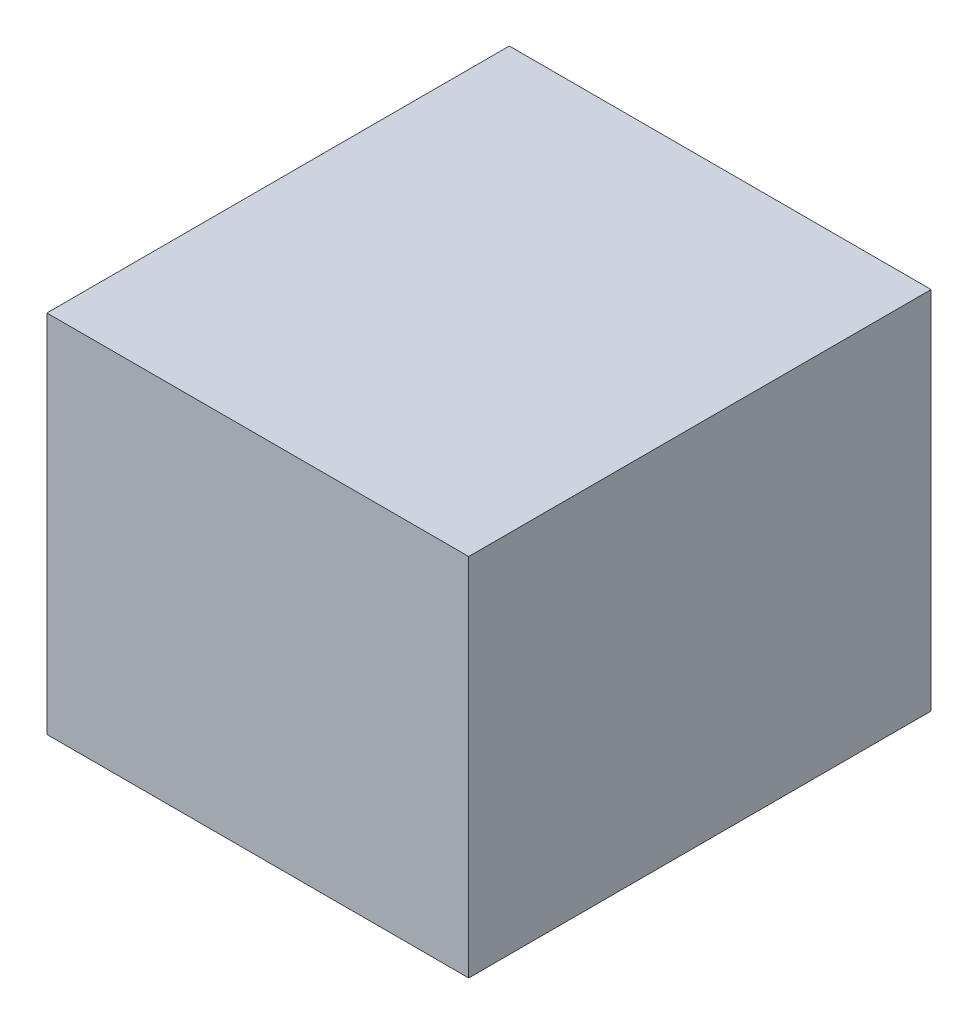
ISO-10303-21;
HEADER;
FILE_DESCRIPTION(('STEP AP214'),'2;1');
FILE_NAME('part.step','',(''),(''),'','','');
FILE_SCHEMA(('AUTOMOTIVE_DESIGN { 1 0 10303 214 1 1 1 1 }'));
ENDSEC;
DATA;
#1=APPLICATION_CONTEXT('core data for automotive mechanical design processes');
#2=APPLICATION_PROTOCOL_DEFINITION('international standard','automotive_design',2000,#1);
#3=PRODUCT_CONTEXT('',#1,'mechanical');
#4=PRODUCT('Part','Part','',(#3));
#5=PRODUCT_RELATED_PRODUCT_CATEGORY('part','',(#4));
#6=PRODUCT_DEFINITION_FORMATION('','',#4);
#7=PRODUCT_DEFINITION_CONTEXT('part definition',#1,'design');
#8=PRODUCT_DEFINITION('design','',#6,#7);
#9=PRODUCT_DEFINITION_SHAPE('','',#8);
#10=(LENGTH_UNIT() NAMED_UNIT(*) SI_UNIT(.MILLI.,.METRE.));
#11=(NAMED_UNIT(*) PLANE_ANGLE_UNIT() SI_UNIT($,.RADIAN.));
#12=(NAMED_UNIT(*) SI_UNIT($,.STERADIAN.) SOLID_ANGLE_UNIT());
#13=UNCERTAINTY_MEASURE_WITH_UNIT(LENGTH_MEASURE(1.E-05),#10,'distance_accuracy_value','');
#14=(GEOMETRIC_REPRESENTATION_CONTEXT(3) GLOBAL_UNCERTAINTY_ASSIGNED_CONTEXT((#13)) GLOBAL_UNIT_ASSIGNED_CONTEXT((#10,
#11,#12)) REPRESENTATION_CONTEXT('',''));
#15=CARTESIAN_POINT('',(0.,0.,0.));
#16=DIRECTION('',(0.,0.,1.));
#17=DIRECTION('',(1.,0.,0.));
#18=AXIS2_PLACEMENT_3D('',#15,#16,#17);
#19=CARTESIAN_POINT('',(-155.,0.,-560.));
#20=DIRECTION('',(1.,0.,0.));
#21=DIRECTION('',(0.,0.,-1.));
#22=AXIS2_PLACEMENT_3D('',#19,#20,#21);
#23=PLANE('',#22);
#24=DIRECTION('',(0.,0.,1.));
#25=VECTOR('',#24,1.);
#26=CARTESIAN_POINT('',(-155.,-225.,-560.));
#27=LINE('',#26,#25);
#28=CARTESIAN_POINT('',(-155.,-225.,-460.));
#29=VERTEX_POINT('',#28);
#30=CARTESIAN_POINT('',(-155.,-225.,0.));
#31=VERTEX_POINT('',#30);
#32=EDGE_CURVE('E101',#29,#31,#27,.T.);
#33=ORIENTED_EDGE('',*,*,#32,.F.);
#34=DIRECTION('',(0.,1.,0.));
#35=VECTOR('',#34,1.);
#36=CARTESIAN_POINT('',(-155.,0.,-460.));
#37=LINE('',#36,#35);
#38=CARTESIAN_POINT('',(-155.,-220.,-460.));
#39=VERTEX_POINT('',#38);
#40=EDGE_CURVE('E96',#29,#39,#37,.T.);
#41=ORIENTED_EDGE('',*,*,#40,.T.);
#42=DIRECTION('',(0.,0.,1.));
#43=VECTOR('',#42,1.);
#44=CARTESIAN_POINT('',(-155.,-220.,-560.));
#45=LINE('',#44,#43);
#46=CARTESIAN_POINT('',(-155.,-220.,0.));
#47=VERTEX_POINT('',#46);
#48=EDGE_CURVE('E209',#39,#47,#45,.T.);
#49=ORIENTED_EDGE('',*,*,#48,.T.);
#50=DIRECTION('',(0.,1.,0.));
#51=VECTOR('',#50,1.);
#52=CARTESIAN_POINT('',(-155.,0.,0.));
#53=LINE('',#52,#51);
#54=EDGE_CURVE('E210',#31,#47,#53,.T.);
#55=ORIENTED_EDGE('',*,*,#54,.F.);
#56=EDGE_LOOP('',(#33,#41,#49,#55));
#57=FACE_BOUND('',#56,.T.);
#58=ADVANCED_FACE('F79',(#57),#23,.T.);
#59=CARTESIAN_POINT('',(155.,-225.,-560.));
#60=DIRECTION('',(1.,0.,0.));
#61=DIRECTION('',(0.,0.,-1.));
#62=AXIS2_PLACEMENT_3D('',#59,#60,#61);
#63=PLANE('',#62);
#64=DIRECTION('',(0.,1.,0.));
#65=VECTOR('',#64,1.);
#66=CARTESIAN_POINT('',(155.,-225.,-460.));
#67=LINE('',#66,#65);
#68=CARTESIAN_POINT('',(155.,-225.,-460.));
#69=VERTEX_POINT('',#68);
#70=CARTESIAN_POINT('',(155.,-220.,-460.));
#71=VERTEX_POINT('',#70);
#72=EDGE_CURVE('E191',#69,#71,#67,.T.);
#73=ORIENTED_EDGE('',*,*,#72,.F.);
#74=DIRECTION('',(0.,0.,1.));
#75=VECTOR('',#74,1.);
#76=CARTESIAN_POINT('',(155.,-225.,-560.));
#77=LINE('',#76,#75);
#78=CARTESIAN_POINT('',(155.,-225.,0.));
#79=VERTEX_POINT('',#78);
#80=EDGE_CURVE('E214',#69,#79,#77,.T.);
#81=ORIENTED_EDGE('',*,*,#80,.T.);
#82=DIRECTION('',(0.,1.,0.));
#83=VECTOR('',#82,1.);
#84=CARTESIAN_POINT('',(155.,-225.,0.));
#85=LINE('',#84,#83);
#86=CARTESIAN_POINT('',(155.,-220.,0.));
#87=VERTEX_POINT('',#86);
#88=EDGE_CURVE('E197',#79,#87,#85,.T.);
#89=ORIENTED_EDGE('',*,*,#88,.T.);
#90=DIRECTION('',(0.,0.,1.));
#91=VECTOR('',#90,1.);
#92=CARTESIAN_POINT('',(155.,-220.,-560.));
#93=LINE('',#92,#91);
#94=EDGE_CURVE('E239',#71,#87,#93,.T.);
#95=ORIENTED_EDGE('',*,*,#94,.F.);
#96=EDGE_LOOP('',(#73,#81,#89,#95));
#97=FACE_BOUND('',#96,.T.);
#98=ADVANCED_FACE('F287',(#97),#63,.F.);
#99=CARTESIAN_POINT('',(260.,-225.,5.));
#100=DIRECTION('',(-1.,0.,0.));
#101=DIRECTION('',(0.,0.,1.));
#102=AXIS2_PLACEMENT_3D('',#99,#100,#101);
#103=PLANE('',#102);
#104=DIRECTION('',(0.,-1.,0.));
#105=VECTOR('',#104,1.);
#106=CARTESIAN_POINT('',(260.,225.,-565.));
#107=LINE('',#106,#105);
#108=CARTESIAN_POINT('',(260.,225.,-565.));
#109=VERTEX_POINT('',#108);
#110=CARTESIAN_POINT('',(260.,-225.,-565.));
#111=VERTEX_POINT('',#110);
#112=EDGE_CURVE('E184',#109,#111,#107,.T.);
#113=ORIENTED_EDGE('',*,*,#112,.F.);
#114=DIRECTION('',(0.,0.,-1.));
#115=VECTOR('',#114,1.);
#116=CARTESIAN_POINT('',(260.,225.,5.));
#117=LINE('',#116,#115);
#118=CARTESIAN_POINT('',(260.,225.,5.));
#119=VERTEX_POINT('',#118);
#120=EDGE_CURVE('E12',#119,#109,#117,.T.);
#121=ORIENTED_EDGE('',*,*,#120,.F.);
#122=DIRECTION('',(0.,1.,0.));
#123=VECTOR('',#122,1.);
#124=CARTESIAN_POINT('',(260.,-225.,5.));
#125=LINE('',#124,#123);
#126=CARTESIAN_POINT('',(260.,-225.,5.));
#127=VERTEX_POINT('',#126);
#128=EDGE_CURVE('E244',#127,#119,#125,.T.);
#129=ORIENTED_EDGE('',*,*,#128,.F.);
#130=DIRECTION('',(0.,0.,-1.));
#131=VECTOR('',#130,1.);
#132=CARTESIAN_POINT('',(260.,-225.,5.));
#133=LINE('',#132,#131);
#134=EDGE_CURVE('E252',#127,#111,#133,.T.);
#135=ORIENTED_EDGE('',*,*,#134,.T.);
#136=EDGE_LOOP('',(#113,#121,#129,#135));
#137=FACE_BOUND('',#136,.T.);
#138=ADVANCED_FACE('F81',(#137),#103,.F.);
#139=CARTESIAN_POINT('',(-260.,225.,5.));
#140=DIRECTION('',(0.,-1.,0.));
#141=DIRECTION('',(0.,0.,-1.));
#142=AXIS2_PLACEMENT_3D('',#139,#140,#141);
#143=PLANE('',#142);
#144=DIRECTION('',(1.,0.,0.));
#145=VECTOR('',#144,1.);
#146=CARTESIAN_POINT('',(-260.,225.,-565.));
#147=LINE('',#146,#145);
#148=CARTESIAN_POINT('',(-260.,225.,-565.));
#149=VERTEX_POINT('',#148);
#150=EDGE_CURVE('E178',#149,#109,#147,.T.);
#151=ORIENTED_EDGE('',*,*,#150,.F.);
#152=DIRECTION('',(0.,0.,-1.));
#153=VECTOR('',#152,1.);
#154=CARTESIAN_POINT('',(-260.,225.,5.));
#155=LINE('',#154,#153);
#156=CARTESIAN_POINT('',(-260.,225.,5.));
#157=VERTEX_POINT('',#156);
#158=EDGE_CURVE('E88',#157,#149,#155,.T.);
#159=ORIENTED_EDGE('',*,*,#158,.F.);
#160=DIRECTION('',(-1.,0.,0.));
#161=VECTOR('',#160,1.);
#162=CARTESIAN_POINT('',(-260.,225.,5.));
#163=LINE('',#162,#161);
#164=EDGE_CURVE('E247',#119,#157,#163,.T.);
#165=ORIENTED_EDGE('',*,*,#164,.F.);
#166=ORIENTED_EDGE('',*,*,#120,.T.);
#167=EDGE_LOOP('',(#151,#159,#165,#166));
#168=FACE_BOUND('',#167,.T.);
#169=ADVANCED_FACE('F179',(#168),#143,.F.);
#170=CARTESIAN_POINT('',(-260.,-225.,5.));
#171=DIRECTION('',(1.,0.,0.));
#172=DIRECTION('',(0.,0.,-1.));
#173=AXIS2_PLACEMENT_3D('',#170,#171,#172);
#174=PLANE('',#173);
#175=DIRECTION('',(0.,1.,0.));
#176=VECTOR('',#175,1.);
#177=CARTESIAN_POINT('',(-260.,225.,-565.));
#178=LINE('',#177,#176);
#179=CARTESIAN_POINT('',(-260.,-225.,-565.));
#180=VERTEX_POINT('',#179);
#181=EDGE_CURVE('E172',#180,#149,#178,.T.);
#182=ORIENTED_EDGE('',*,*,#181,.F.);
#183=DIRECTION('',(0.,0.,-1.));
#184=VECTOR('',#183,1.);
#185=CARTESIAN_POINT('',(-260.,-225.,5.));
#186=LINE('',#185,#184);
#187=CARTESIAN_POINT('',(-260.,-225.,5.));
#188=VERTEX_POINT('',#187);
#189=EDGE_CURVE('E175',#188,#180,#186,.T.);
#190=ORIENTED_EDGE('',*,*,#189,.F.);
#191=DIRECTION('',(0.,-1.,0.));
#192=VECTOR('',#191,1.);
#193=CARTESIAN_POINT('',(-260.,-225.,5.));
#194=LINE('',#193,#192);
#195=EDGE_CURVE('E173',#157,#188,#194,.T.);
#196=ORIENTED_EDGE('',*,*,#195,.F.);
#197=ORIENTED_EDGE('',*,*,#158,.T.);
#198=EDGE_LOOP('',(#182,#190,#196,#197));
#199=FACE_BOUND('',#198,.T.);
#200=ADVANCED_FACE('F169',(#199),#174,.F.);
#201=CARTESIAN_POINT('',(-260.,-225.,5.));
#202=DIRECTION('',(0.,1.,0.));
#203=DIRECTION('',(0.,0.,1.));
#204=AXIS2_PLACEMENT_3D('',#201,#202,#203);
#205=PLANE('',#204);
#206=CARTESIAN_POINT('',(-169.55,-225.,-10.));
#207=DIRECTION('',(0.,-1.,0.));
#208=DIRECTION('',(0.,0.,-1.));
#209=AXIS2_PLACEMENT_3D('',#206,#207,#208);
#210=CIRCLE('',#209,2.5);
#211=CARTESIAN_POINT('',(-169.55,-225.,-12.5));
#212=VERTEX_POINT('',#211);
#213=EDGE_CURVE('E261',#212,#212,#210,.T.);
#214=ORIENTED_EDGE('',*,*,#213,.F.);
#215=EDGE_LOOP('',(#214));
#216=FACE_BOUND('',#215,.T.);
#217=CARTESIAN_POINT('',(-169.55,-225.,-424.));
#218=DIRECTION('',(0.,-1.,0.));
#219=DIRECTION('',(0.,0.,-1.));
#220=AXIS2_PLACEMENT_3D('',#217,#218,#219);
#221=CIRCLE('',#220,2.5);
#222=CARTESIAN_POINT('',(-169.55,-225.,-426.5));
#223=VERTEX_POINT('',#222);
#224=EDGE_CURVE('E486',#223,#223,#221,.T.);
#225=ORIENTED_EDGE('',*,*,#224,.F.);
#226=EDGE_LOOP('',(#225));
#227=FACE_BOUND('',#226,.T.);
#228=CARTESIAN_POINT('',(-169.55,-225.,-450.));
#229=DIRECTION('',(0.,-1.,0.));
#230=DIRECTION('',(0.,0.,-1.));
#231=AXIS2_PLACEMENT_3D('',#228,#229,#230);
#232=CIRCLE('',#231,2.5);
#233=CARTESIAN_POINT('',(-169.55,-225.,-452.5));
#234=VERTEX_POINT('',#233);
#235=EDGE_CURVE('E279',#234,#234,#232,.T.);
#236=ORIENTED_EDGE('',*,*,#235,.F.);
#237=EDGE_LOOP('',(#236));
#238=FACE_BOUND('',#237,.T.);
#239=CARTESIAN_POINT('',(-169.55,-225.,-36.));
#240=DIRECTION('',(0.,-1.,0.));
#241=DIRECTION('',(0.,0.,-1.));
#242=AXIS2_PLACEMENT_3D('',#239,#240,#241);
#243=CIRCLE('',#242,2.5);
#244=CARTESIAN_POINT('',(-169.55,-225.,-38.5));
#245=VERTEX_POINT('',#244);
#246=EDGE_CURVE('E482',#245,#245,#243,.T.);
#247=ORIENTED_EDGE('',*,*,#246,.F.);
#248=EDGE_LOOP('',(#247));
#249=FACE_BOUND('',#248,.T.);
#250=ORIENTED_EDGE('',*,*,#80,.F.);
#251=DIRECTION('',(1.,0.,0.));
#252=VECTOR('',#251,1.);
#253=CARTESIAN_POINT('',(-260.,-225.,-460.));
#254=LINE('',#253,#252);
#255=EDGE_CURVE('E272',#29,#69,#254,.T.);
#256=ORIENTED_EDGE('',*,*,#255,.F.);
#257=ORIENTED_EDGE('',*,*,#32,.T.);
#258=DIRECTION('',(1.,0.,0.));
#259=VECTOR('',#258,1.);
#260=CARTESIAN_POINT('',(-260.,-225.,0.));
#261=LINE('',#260,#259);
#262=EDGE_CURVE('E243',#31,#79,#261,.T.);
#263=ORIENTED_EDGE('',*,*,#262,.T.);
#264=EDGE_LOOP('',(#250,#256,#257,#263));
#265=FACE_BOUND('',#264,.T.);
#266=ORIENTED_EDGE('',*,*,#189,.T.);
#267=DIRECTION('',(-1.,0.,0.));
#268=VECTOR('',#267,1.);
#269=CARTESIAN_POINT('',(-260.,-225.,-565.));
#270=LINE('',#269,#268);
#271=EDGE_CURVE('E189',#111,#180,#270,.T.);
#272=ORIENTED_EDGE('',*,*,#271,.F.);
#273=ORIENTED_EDGE('',*,*,#134,.F.);
#274=DIRECTION('',(1.,0.,0.));
#275=VECTOR('',#274,1.);
#276=CARTESIAN_POINT('',(-260.,-225.,5.));
#277=LINE('',#276,#275);
#278=EDGE_CURVE('E250',#188,#127,#277,.T.);
#279=ORIENTED_EDGE('',*,*,#278,.F.);
#280=EDGE_LOOP('',(#266,#272,#273,#279));
#281=FACE_BOUND('',#280,.T.);
#282=ADVANCED_FACE('F290',(#216,#227,#238,#249,#265,#281),#205,.F.);
#283=CARTESIAN_POINT('',(0.,0.,5.));
#284=DIRECTION('',(0.,0.,-1.));
#285=DIRECTION('',(-1.,0.,0.));
#286=AXIS2_PLACEMENT_3D('',#283,#284,#285);
#287=PLANE('',#286);
#288=ORIENTED_EDGE('',*,*,#128,.T.);
#289=ORIENTED_EDGE('',*,*,#164,.T.);
#290=ORIENTED_EDGE('',*,*,#195,.T.);
#291=ORIENTED_EDGE('',*,*,#278,.T.);
#292=EDGE_LOOP('',(#288,#289,#290,#291));
#293=FACE_BOUND('',#292,.T.);
#294=ADVANCED_FACE('F322',(#293),#287,.F.);
#295=CARTESIAN_POINT('',(0.,0.,0.));
#296=DIRECTION('',(0.,0.,-1.));
#297=DIRECTION('',(-1.,0.,0.));
#298=AXIS2_PLACEMENT_3D('',#295,#296,#297);
#299=PLANE('',#298);
#300=ORIENTED_EDGE('',*,*,#88,.F.);
#301=ORIENTED_EDGE('',*,*,#262,.F.);
#302=ORIENTED_EDGE('',*,*,#54,.T.);
#303=DIRECTION('',(1.,0.,0.));
#304=VECTOR('',#303,1.);
#305=CARTESIAN_POINT('',(0.,-220.,0.));
#306=LINE('',#305,#304);
#307=CARTESIAN_POINT('',(-255.,-220.,0.));
#308=VERTEX_POINT('',#307);
#309=EDGE_CURVE('E201',#308,#47,#306,.T.);
#310=ORIENTED_EDGE('',*,*,#309,.F.);
#311=DIRECTION('',(0.,1.,0.));
#312=VECTOR('',#311,1.);
#313=CARTESIAN_POINT('',(-255.,0.,0.));
#314=LINE('',#313,#312);
#315=CARTESIAN_POINT('',(-255.,220.,0.));
#316=VERTEX_POINT('',#315);
#317=EDGE_CURVE('E220',#308,#316,#314,.T.);
#318=ORIENTED_EDGE('',*,*,#317,.T.);
#319=DIRECTION('',(1.,0.,0.));
#320=VECTOR('',#319,1.);
#321=CARTESIAN_POINT('',(0.,220.,0.));
#322=LINE('',#321,#320);
#323=CARTESIAN_POINT('',(255.,220.,0.));
#324=VERTEX_POINT('',#323);
#325=EDGE_CURVE('E217',#316,#324,#322,.T.);
#326=ORIENTED_EDGE('',*,*,#325,.T.);
#327=DIRECTION('',(0.,1.,0.));
#328=VECTOR('',#327,1.);
#329=CARTESIAN_POINT('',(255.,0.,0.));
#330=LINE('',#329,#328);
#331=CARTESIAN_POINT('',(255.,-220.,0.));
#332=VERTEX_POINT('',#331);
#333=EDGE_CURVE('E213',#332,#324,#330,.T.);
#334=ORIENTED_EDGE('',*,*,#333,.F.);
#335=DIRECTION('',(-1.,0.,0.));
#336=VECTOR('',#335,1.);
#337=CARTESIAN_POINT('',(260.,-220.,0.));
#338=LINE('',#337,#336);
#339=EDGE_CURVE('E236',#332,#87,#338,.T.);
#340=ORIENTED_EDGE('',*,*,#339,.T.);
#341=EDGE_LOOP('',(#300,#301,#302,#310,#318,#326,#334,#340));
#342=FACE_BOUND('',#341,.T.);
#343=ADVANCED_FACE('F294',(#342),#299,.T.);
#344=CARTESIAN_POINT('',(0.,220.,-560.));
#345=DIRECTION('',(0.,-1.,0.));
#346=DIRECTION('',(0.,0.,-1.));
#347=AXIS2_PLACEMENT_3D('',#344,#345,#346);
#348=PLANE('',#347);
#349=DIRECTION('',(0.,0.,1.));
#350=VECTOR('',#349,1.);
#351=CARTESIAN_POINT('',(255.,220.,-560.));
#352=LINE('',#351,#350);
#353=CARTESIAN_POINT('',(255.,220.,-560.));
#354=VERTEX_POINT('',#353);
#355=EDGE_CURVE('E230',#354,#324,#352,.T.);
#356=ORIENTED_EDGE('',*,*,#355,.T.);
#357=ORIENTED_EDGE('',*,*,#325,.F.);
#358=DIRECTION('',(0.,0.,1.));
#359=VECTOR('',#358,1.);
#360=CARTESIAN_POINT('',(-255.,220.,-560.));
#361=LINE('',#360,#359);
#362=CARTESIAN_POINT('',(-255.,220.,-560.));
#363=VERTEX_POINT('',#362);
#364=EDGE_CURVE('E228',#363,#316,#361,.T.);
#365=ORIENTED_EDGE('',*,*,#364,.F.);
#366=DIRECTION('',(1.,0.,0.));
#367=VECTOR('',#366,1.);
#368=CARTESIAN_POINT('',(0.,220.,-560.));
#369=LINE('',#368,#367);
#370=EDGE_CURVE('E200',#363,#354,#369,.T.);
#371=ORIENTED_EDGE('',*,*,#370,.T.);
#372=EDGE_LOOP('',(#356,#357,#365,#371));
#373=FACE_BOUND('',#372,.T.);
#374=ADVANCED_FACE('F314',(#373),#348,.T.);
#375=CARTESIAN_POINT('',(-255.,0.,-560.));
#376=DIRECTION('',(1.,0.,0.));
#377=DIRECTION('',(0.,0.,-1.));
#378=AXIS2_PLACEMENT_3D('',#375,#376,#377);
#379=PLANE('',#378);
#380=ORIENTED_EDGE('',*,*,#364,.T.);
#381=ORIENTED_EDGE('',*,*,#317,.F.);
#382=DIRECTION('',(0.,0.,1.));
#383=VECTOR('',#382,1.);
#384=CARTESIAN_POINT('',(-255.,-220.,-560.));
#385=LINE('',#384,#383);
#386=CARTESIAN_POINT('',(-255.,-220.,-560.));
#387=VERTEX_POINT('',#386);
#388=EDGE_CURVE('E226',#387,#308,#385,.T.);
#389=ORIENTED_EDGE('',*,*,#388,.F.);
#390=DIRECTION('',(0.,1.,0.));
#391=VECTOR('',#390,1.);
#392=CARTESIAN_POINT('',(-255.,0.,-560.));
#393=LINE('',#392,#391);
#394=EDGE_CURVE('E204',#387,#363,#393,.T.);
#395=ORIENTED_EDGE('',*,*,#394,.T.);
#396=EDGE_LOOP('',(#380,#381,#389,#395));
#397=FACE_BOUND('',#396,.T.);
#398=ADVANCED_FACE('F311',(#397),#379,.T.);
#399=CARTESIAN_POINT('',(0.,-220.,-560.));
#400=DIRECTION('',(0.,-1.,0.));
#401=DIRECTION('',(0.,0.,-1.));
#402=AXIS2_PLACEMENT_3D('',#399,#400,#401);
#403=PLANE('',#402);
#404=CARTESIAN_POINT('',(-169.55,-220.,-10.));
#405=DIRECTION('',(0.,-1.,0.));
#406=DIRECTION('',(0.,0.,-1.));
#407=AXIS2_PLACEMENT_3D('',#404,#405,#406);
#408=CIRCLE('',#407,2.5);
#409=CARTESIAN_POINT('',(-169.55,-220.,-12.5));
#410=VERTEX_POINT('',#409);
#411=EDGE_CURVE('E83',#410,#410,#408,.T.);
#412=ORIENTED_EDGE('',*,*,#411,.T.);
#413=EDGE_LOOP('',(#412));
#414=FACE_BOUND('',#413,.T.);
#415=CARTESIAN_POINT('',(-169.55,-220.,-424.));
#416=DIRECTION('',(0.,-1.,0.));
#417=DIRECTION('',(0.,0.,-1.));
#418=AXIS2_PLACEMENT_3D('',#415,#416,#417);
#419=CIRCLE('',#418,2.5);
#420=CARTESIAN_POINT('',(-169.55,-220.,-426.5));
#421=VERTEX_POINT('',#420);
#422=EDGE_CURVE('E263',#421,#421,#419,.T.);
#423=ORIENTED_EDGE('',*,*,#422,.T.);
#424=EDGE_LOOP('',(#423));
#425=FACE_BOUND('',#424,.T.);
#426=CARTESIAN_POINT('',(-169.55,-220.,-450.));
#427=DIRECTION('',(0.,-1.,0.));
#428=DIRECTION('',(0.,0.,-1.));
#429=AXIS2_PLACEMENT_3D('',#426,#427,#428);
#430=CIRCLE('',#429,2.5);
#431=CARTESIAN_POINT('',(-169.55,-220.,-452.5));
#432=VERTEX_POINT('',#431);
#433=EDGE_CURVE('E260',#432,#432,#430,.T.);
#434=ORIENTED_EDGE('',*,*,#433,.T.);
#435=EDGE_LOOP('',(#434));
#436=FACE_BOUND('',#435,.T.);
#437=CARTESIAN_POINT('',(-169.55,-220.,-36.));
#438=DIRECTION('',(0.,-1.,0.));
#439=DIRECTION('',(0.,0.,-1.));
#440=AXIS2_PLACEMENT_3D('',#437,#438,#439);
#441=CIRCLE('',#440,2.5);
#442=CARTESIAN_POINT('',(-169.55,-220.,-38.5));
#443=VERTEX_POINT('',#442);
#444=EDGE_CURVE('E257',#443,#443,#441,.T.);
#445=ORIENTED_EDGE('',*,*,#444,.T.);
#446=EDGE_LOOP('',(#445));
#447=FACE_BOUND('',#446,.T.);
#448=ORIENTED_EDGE('',*,*,#388,.T.);
#449=ORIENTED_EDGE('',*,*,#309,.T.);
#450=ORIENTED_EDGE('',*,*,#48,.F.);
#451=DIRECTION('',(1.,0.,0.));
#452=VECTOR('',#451,1.);
#453=CARTESIAN_POINT('',(-255.,-220.,-460.));
#454=LINE('',#453,#452);
#455=EDGE_CURVE('E268',#39,#71,#454,.T.);
#456=ORIENTED_EDGE('',*,*,#455,.T.);
#457=ORIENTED_EDGE('',*,*,#94,.T.);
#458=ORIENTED_EDGE('',*,*,#339,.F.);
#459=DIRECTION('',(0.,0.,1.));
#460=VECTOR('',#459,1.);
#461=CARTESIAN_POINT('',(255.,-220.,-560.));
#462=LINE('',#461,#460);
#463=CARTESIAN_POINT('',(255.,-220.,-560.));
#464=VERTEX_POINT('',#463);
#465=EDGE_CURVE('E233',#464,#332,#462,.T.);
#466=ORIENTED_EDGE('',*,*,#465,.F.);
#467=DIRECTION('',(1.,0.,0.));
#468=VECTOR('',#467,1.);
#469=CARTESIAN_POINT('',(0.,-220.,-560.));
#470=LINE('',#469,#468);
#471=EDGE_CURVE('E207',#387,#464,#470,.T.);
#472=ORIENTED_EDGE('',*,*,#471,.F.);
#473=EDGE_LOOP('',(#448,#449,#450,#456,#457,#458,#466,#472));
#474=FACE_BOUND('',#473,.T.);
#475=ADVANCED_FACE('F299',(#414,#425,#436,#447,#474),#403,.F.);
#476=CARTESIAN_POINT('',(255.,0.,-560.));
#477=DIRECTION('',(1.,0.,0.));
#478=DIRECTION('',(0.,0.,-1.));
#479=AXIS2_PLACEMENT_3D('',#476,#477,#478);
#480=PLANE('',#479);
#481=ORIENTED_EDGE('',*,*,#465,.T.);
#482=ORIENTED_EDGE('',*,*,#333,.T.);
#483=ORIENTED_EDGE('',*,*,#355,.F.);
#484=DIRECTION('',(0.,1.,0.));
#485=VECTOR('',#484,1.);
#486=CARTESIAN_POINT('',(255.,0.,-560.));
#487=LINE('',#486,#485);
#488=EDGE_CURVE('E198',#464,#354,#487,.T.);
#489=ORIENTED_EDGE('',*,*,#488,.F.);
#490=EDGE_LOOP('',(#481,#482,#483,#489));
#491=FACE_BOUND('',#490,.T.);
#492=ADVANCED_FACE('F304',(#491),#480,.F.);
#493=CARTESIAN_POINT('',(0.,0.,-565.));
#494=DIRECTION('',(0.,0.,1.));
#495=DIRECTION('',(1.,0.,0.));
#496=AXIS2_PLACEMENT_3D('',#493,#494,#495);
#497=PLANE('',#496);
#498=ORIENTED_EDGE('',*,*,#181,.T.);
#499=ORIENTED_EDGE('',*,*,#150,.T.);
#500=ORIENTED_EDGE('',*,*,#112,.T.);
#501=ORIENTED_EDGE('',*,*,#271,.T.);
#502=EDGE_LOOP('',(#498,#499,#500,#501));
#503=FACE_BOUND('',#502,.T.);
#504=ADVANCED_FACE('F187',(#503),#497,.F.);
#505=CARTESIAN_POINT('',(0.,0.,-560.));
#506=DIRECTION('',(0.,0.,1.));
#507=DIRECTION('',(1.,0.,0.));
#508=AXIS2_PLACEMENT_3D('',#505,#506,#507);
#509=PLANE('',#508);
#510=ORIENTED_EDGE('',*,*,#471,.T.);
#511=ORIENTED_EDGE('',*,*,#488,.T.);
#512=ORIENTED_EDGE('',*,*,#370,.F.);
#513=ORIENTED_EDGE('',*,*,#394,.F.);
#514=EDGE_LOOP('',(#510,#511,#512,#513));
#515=FACE_BOUND('',#514,.T.);
#516=ADVANCED_FACE('F306',(#515),#509,.T.);
#517=CARTESIAN_POINT('',(0.,0.,-460.));
#518=DIRECTION('',(0.,0.,-1.));
#519=DIRECTION('',(-1.,0.,0.));
#520=AXIS2_PLACEMENT_3D('',#517,#518,#519);
#521=PLANE('',#520);
#522=ORIENTED_EDGE('',*,*,#40,.F.);
#523=ORIENTED_EDGE('',*,*,#255,.T.);
#524=ORIENTED_EDGE('',*,*,#72,.T.);
#525=ORIENTED_EDGE('',*,*,#455,.F.);
#526=EDGE_LOOP('',(#522,#523,#524,#525));
#527=FACE_BOUND('',#526,.T.);
#528=ADVANCED_FACE('F283',(#527),#521,.F.);
#529=CARTESIAN_POINT('',(-169.55,-215.,-36.));
#530=DIRECTION('',(0.,-1.,0.));
#531=DIRECTION('',(0.,0.,-1.));
#532=AXIS2_PLACEMENT_3D('',#529,#530,#531);
#533=CYLINDRICAL_SURFACE('',#532,2.5);
#534=ORIENTED_EDGE('',*,*,#246,.T.);
#535=EDGE_LOOP('',(#534));
#536=FACE_BOUND('',#535,.T.);
#537=ORIENTED_EDGE('',*,*,#444,.F.);
#538=EDGE_LOOP('',(#537));
#539=FACE_BOUND('',#538,.T.);
#540=ADVANCED_FACE('F429',(#536,#539),#533,.F.);
#541=CARTESIAN_POINT('',(-169.55,-215.,-450.));
#542=DIRECTION('',(0.,-1.,0.));
#543=DIRECTION('',(0.,0.,-1.));
#544=AXIS2_PLACEMENT_3D('',#541,#542,#543);
#545=CYLINDRICAL_SURFACE('',#544,2.5);
#546=ORIENTED_EDGE('',*,*,#235,.T.);
#547=EDGE_LOOP('',(#546));
#548=FACE_BOUND('',#547,.T.);
#549=ORIENTED_EDGE('',*,*,#433,.F.);
#550=EDGE_LOOP('',(#549));
#551=FACE_BOUND('',#550,.T.);
#552=ADVANCED_FACE('F434',(#548,#551),#545,.F.);
#553=CARTESIAN_POINT('',(-169.55,-215.,-424.));
#554=DIRECTION('',(0.,-1.,0.));
#555=DIRECTION('',(0.,0.,-1.));
#556=AXIS2_PLACEMENT_3D('',#553,#554,#555);
#557=CYLINDRICAL_SURFACE('',#556,2.5);
#558=ORIENTED_EDGE('',*,*,#224,.T.);
#559=EDGE_LOOP('',(#558));
#560=FACE_BOUND('',#559,.T.);
#561=ORIENTED_EDGE('',*,*,#422,.F.);
#562=EDGE_LOOP('',(#561));
#563=FACE_BOUND('',#562,.T.);
#564=ADVANCED_FACE('F445',(#560,#563),#557,.F.);
#565=CARTESIAN_POINT('',(-169.55,-215.,-10.));
#566=DIRECTION('',(0.,-1.,0.));
#567=DIRECTION('',(0.,0.,-1.));
#568=AXIS2_PLACEMENT_3D('',#565,#566,#567);
#569=CYLINDRICAL_SURFACE('',#568,2.5);
#570=ORIENTED_EDGE('',*,*,#213,.T.);
#571=EDGE_LOOP('',(#570));
#572=FACE_BOUND('',#571,.T.);
#573=ORIENTED_EDGE('',*,*,#411,.F.);
#574=EDGE_LOOP('',(#573));
#575=FACE_BOUND('',#574,.T.);
#576=ADVANCED_FACE('F455',(#572,#575),#569,.F.);
#577=CLOSED_SHELL('',(#58,#98,#138,#169,#200,#282,#294,#343,#374,#398,#475,#492,#504,#516,#528,
#540,#552,#564,#576));
#578=MANIFOLD_SOLID_BREP('B2',#577);
#579=ADVANCED_BREP_SHAPE_REPRESENTATION('',(#18,#578),#14);
#580=SHAPE_DEFINITION_REPRESENTATION(#9,#579);
ENDSEC;
END-ISO-10303-21;
